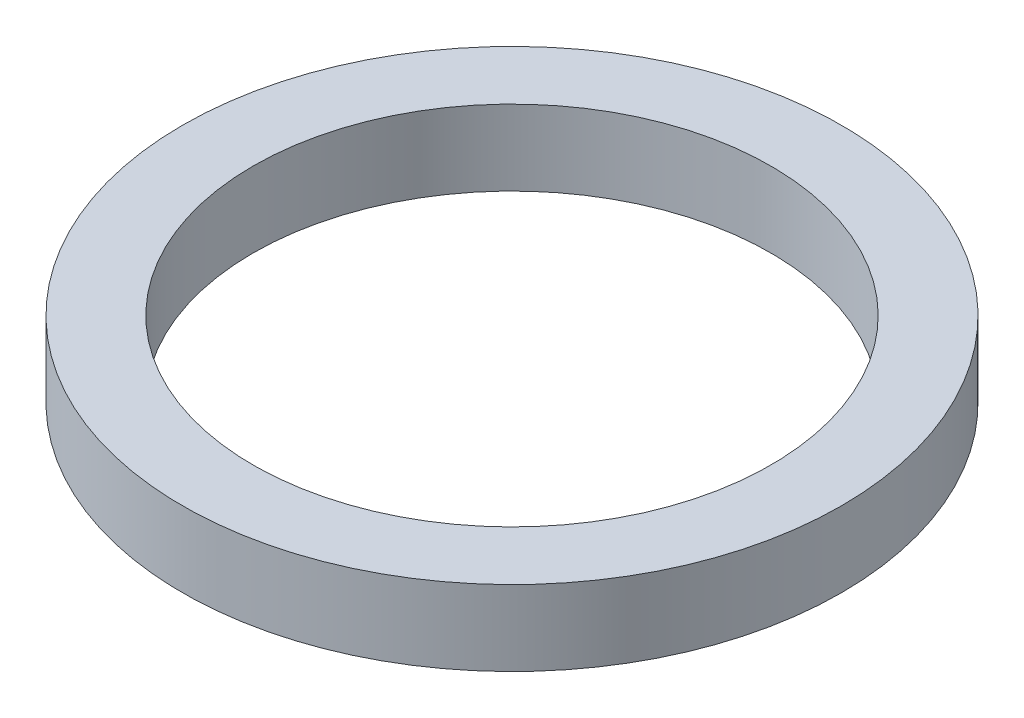
ISO-10303-21;
HEADER;
FILE_DESCRIPTION(('STEP AP214'),'2;1');
FILE_NAME('part.step','',(''),(''),'','','');
FILE_SCHEMA(('AUTOMOTIVE_DESIGN { 1 0 10303 214 1 1 1 1 }'));
ENDSEC;
DATA;
#1=APPLICATION_CONTEXT('core data for automotive mechanical design processes');
#2=APPLICATION_PROTOCOL_DEFINITION('international standard','automotive_design',2000,#1);
#3=PRODUCT_CONTEXT('',#1,'mechanical');
#4=PRODUCT('Part','Part','',(#3));
#5=PRODUCT_RELATED_PRODUCT_CATEGORY('part','',(#4));
#6=PRODUCT_DEFINITION_FORMATION('','',#4);
#7=PRODUCT_DEFINITION_CONTEXT('part definition',#1,'design');
#8=PRODUCT_DEFINITION('design','',#6,#7);
#9=PRODUCT_DEFINITION_SHAPE('','',#8);
#10=(LENGTH_UNIT() NAMED_UNIT(*) SI_UNIT(.MILLI.,.METRE.));
#11=(NAMED_UNIT(*) PLANE_ANGLE_UNIT() SI_UNIT($,.RADIAN.));
#12=(NAMED_UNIT(*) SI_UNIT($,.STERADIAN.) SOLID_ANGLE_UNIT());
#13=UNCERTAINTY_MEASURE_WITH_UNIT(LENGTH_MEASURE(1.E-05),#10,'distance_accuracy_value','');
#14=(GEOMETRIC_REPRESENTATION_CONTEXT(3) GLOBAL_UNCERTAINTY_ASSIGNED_CONTEXT((#13)) GLOBAL_UNIT_ASSIGNED_CONTEXT((#10,
#11,#12)) REPRESENTATION_CONTEXT('',''));
#15=CARTESIAN_POINT('',(0.,0.,0.));
#16=DIRECTION('',(0.,0.,1.));
#17=DIRECTION('',(1.,0.,0.));
#18=AXIS2_PLACEMENT_3D('',#15,#16,#17);
#19=CARTESIAN_POINT('',(-1.42016028566634E-13,-76.75,0.));
#20=DIRECTION('',(0.,-1.,0.));
#21=DIRECTION('',(1.,0.,0.));
#22=AXIS2_PLACEMENT_3D('',#19,#20,#21);
#23=PLANE('',#22);
#24=CARTESIAN_POINT('',(0.,-76.75,0.));
#25=DIRECTION('',(0.,1.,0.));
#26=DIRECTION('',(-1.,0.,0.));
#27=AXIS2_PLACEMENT_3D('',#24,#25,#26);
#28=CIRCLE('',#27,55.);
#29=CARTESIAN_POINT('',(-55.,-76.75,0.));
#30=VERTEX_POINT('',#29);
#31=EDGE_CURVE('E10',#30,#30,#28,.T.);
#32=ORIENTED_EDGE('',*,*,#31,.F.);
#33=EDGE_LOOP('',(#32));
#34=FACE_BOUND('',#33,.T.);
#35=CARTESIAN_POINT('',(0.,-76.75,0.));
#36=DIRECTION('',(0.,1.,0.));
#37=DIRECTION('',(-1.,0.,0.));
#38=AXIS2_PLACEMENT_3D('',#35,#36,#37);
#39=CIRCLE('',#38,70.);
#40=CARTESIAN_POINT('',(-70.,-76.7500000000001,0.));
#41=VERTEX_POINT('',#40);
#42=EDGE_CURVE('E49',#41,#41,#39,.T.);
#43=ORIENTED_EDGE('',*,*,#42,.T.);
#44=EDGE_LOOP('',(#43));
#45=FACE_BOUND('',#44,.T.);
#46=ADVANCED_FACE('F35',(#34,#45),#23,.F.);
#47=CARTESIAN_POINT('',(0.,-62.,0.));
#48=DIRECTION('',(0.,1.,0.));
#49=DIRECTION('',(-1.,0.,0.));
#50=AXIS2_PLACEMENT_3D('',#47,#48,#49);
#51=CYLINDRICAL_SURFACE('',#50,55.);
#52=CARTESIAN_POINT('',(0.,-92.75,0.));
#53=DIRECTION('',(0.,1.,0.));
#54=DIRECTION('',(-1.,0.,0.));
#55=AXIS2_PLACEMENT_3D('',#52,#53,#54);
#56=CIRCLE('',#55,55.);
#57=CARTESIAN_POINT('',(-55.,-92.75,0.));
#58=VERTEX_POINT('',#57);
#59=EDGE_CURVE('E41',#58,#58,#56,.T.);
#60=ORIENTED_EDGE('',*,*,#59,.F.);
#61=EDGE_LOOP('',(#60));
#62=FACE_BOUND('',#61,.T.);
#63=ORIENTED_EDGE('',*,*,#31,.T.);
#64=EDGE_LOOP('',(#63));
#65=FACE_BOUND('',#64,.T.);
#66=ADVANCED_FACE('F64',(#62,#65),#51,.F.);
#67=CARTESIAN_POINT('',(-1.71621975889972E-13,-92.75,0.));
#68=DIRECTION('',(0.,-1.,0.));
#69=DIRECTION('',(1.,0.,0.));
#70=AXIS2_PLACEMENT_3D('',#67,#68,#69);
#71=PLANE('',#70);
#72=ORIENTED_EDGE('',*,*,#59,.T.);
#73=EDGE_LOOP('',(#72));
#74=FACE_BOUND('',#73,.T.);
#75=CARTESIAN_POINT('',(0.,-92.75,0.));
#76=DIRECTION('',(0.,1.,0.));
#77=DIRECTION('',(-1.,0.,0.));
#78=AXIS2_PLACEMENT_3D('',#75,#76,#77);
#79=CIRCLE('',#78,70.);
#80=CARTESIAN_POINT('',(-70.,-92.75,0.));
#81=VERTEX_POINT('',#80);
#82=EDGE_CURVE('E45',#81,#81,#79,.T.);
#83=ORIENTED_EDGE('',*,*,#82,.F.);
#84=EDGE_LOOP('',(#83));
#85=FACE_BOUND('',#84,.T.);
#86=ADVANCED_FACE('F58',(#74,#85),#71,.T.);
#87=CARTESIAN_POINT('',(0.,-62.,0.));
#88=DIRECTION('',(0.,1.,0.));
#89=DIRECTION('',(-1.,0.,0.));
#90=AXIS2_PLACEMENT_3D('',#87,#88,#89);
#91=CYLINDRICAL_SURFACE('',#90,70.);
#92=ORIENTED_EDGE('',*,*,#82,.T.);
#93=EDGE_LOOP('',(#92));
#94=FACE_BOUND('',#93,.T.);
#95=ORIENTED_EDGE('',*,*,#42,.F.);
#96=EDGE_LOOP('',(#95));
#97=FACE_BOUND('',#96,.T.);
#98=ADVANCED_FACE('F56',(#94,#97),#91,.T.);
#99=CLOSED_SHELL('',(#46,#66,#86,#98));
#100=MANIFOLD_SOLID_BREP('B2',#99);
#101=ADVANCED_BREP_SHAPE_REPRESENTATION('',(#18,#100),#14);
#102=SHAPE_DEFINITION_REPRESENTATION(#9,#101);
ENDSEC;
END-ISO-10303-21;
